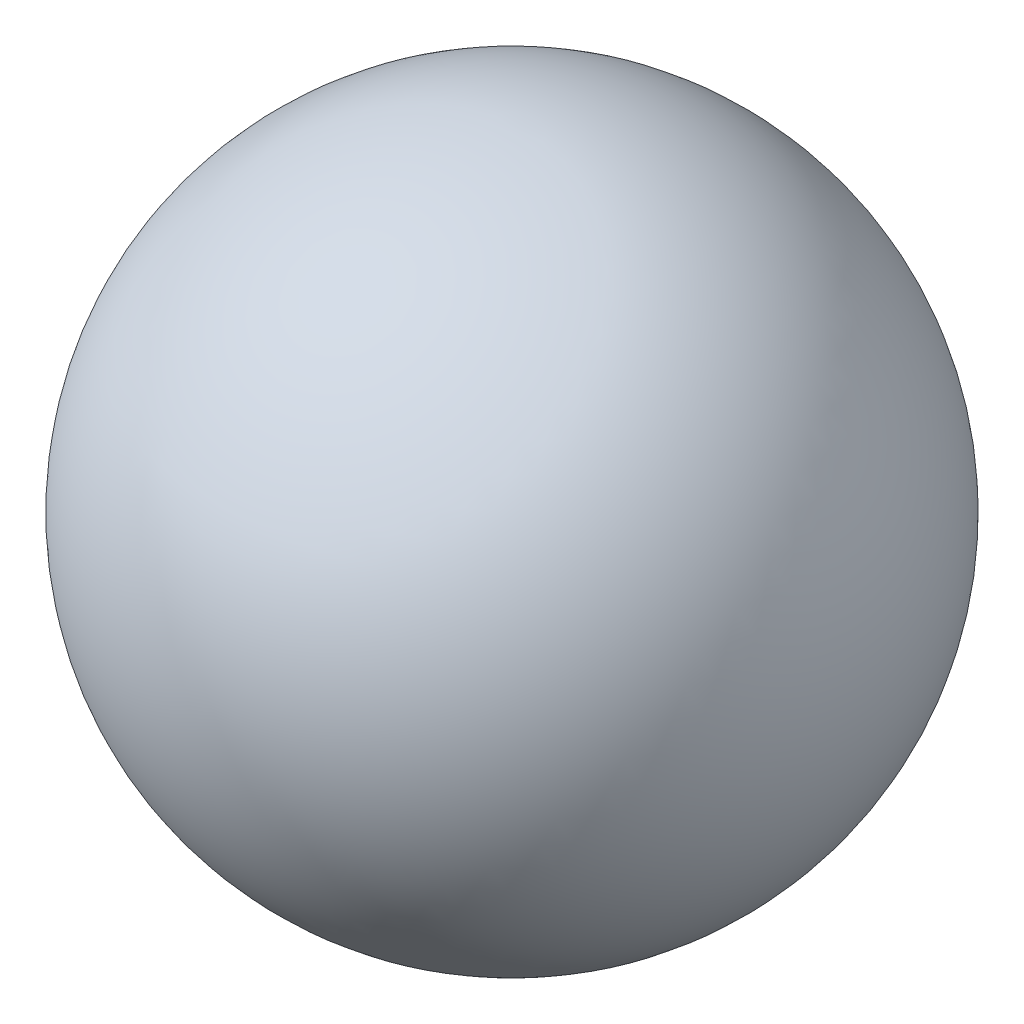
ISO-10303-21;
HEADER;
FILE_DESCRIPTION(('STEP AP214'),'2;1');
FILE_NAME('part.step','',(''),(''),'','','');
FILE_SCHEMA(('AUTOMOTIVE_DESIGN { 1 0 10303 214 1 1 1 1 }'));
ENDSEC;
DATA;
#1=APPLICATION_CONTEXT('core data for automotive mechanical design processes');
#2=APPLICATION_PROTOCOL_DEFINITION('international standard','automotive_design',2000,#1);
#3=PRODUCT_CONTEXT('',#1,'mechanical');
#4=PRODUCT('Part','Part','',(#3));
#5=PRODUCT_RELATED_PRODUCT_CATEGORY('part','',(#4));
#6=PRODUCT_DEFINITION_FORMATION('','',#4);
#7=PRODUCT_DEFINITION_CONTEXT('part definition',#1,'design');
#8=PRODUCT_DEFINITION('design','',#6,#7);
#9=PRODUCT_DEFINITION_SHAPE('','',#8);
#10=(LENGTH_UNIT() NAMED_UNIT(*) SI_UNIT(.MILLI.,.METRE.));
#11=(NAMED_UNIT(*) PLANE_ANGLE_UNIT() SI_UNIT($,.RADIAN.));
#12=(NAMED_UNIT(*) SI_UNIT($,.STERADIAN.) SOLID_ANGLE_UNIT());
#13=UNCERTAINTY_MEASURE_WITH_UNIT(LENGTH_MEASURE(1.E-05),#10,'distance_accuracy_value','');
#14=(GEOMETRIC_REPRESENTATION_CONTEXT(3) GLOBAL_UNCERTAINTY_ASSIGNED_CONTEXT((#13)) GLOBAL_UNIT_ASSIGNED_CONTEXT((#10,
#11,#12)) REPRESENTATION_CONTEXT('',''));
#15=CARTESIAN_POINT('',(0.,0.,0.));
#16=DIRECTION('',(0.,0.,1.));
#17=DIRECTION('',(1.,0.,0.));
#18=AXIS2_PLACEMENT_3D('',#15,#16,#17);
#19=CARTESIAN_POINT('',(-0.7065039653113,0.,-3.095396121177));
#20=DIRECTION('',(0.,-1.,0.));
#21=DIRECTION('',(0.974927912181826,0.,-0.222520933956306));
#22=AXIS2_PLACEMENT_3D('',#19,#20,#21);
#23=SPHERICAL_SURFACE('',#22,0.794);
#24=CARTESIAN_POINT('',(-0.7065039653113,-0.794,-3.095396121177));
#25=VERTEX_POINT('',#24);
#26=VERTEX_LOOP('',#25);
#27=FACE_BOUND('',#26,.T.);
#28=ADVANCED_FACE('F12',(#27),#23,.T.);
#29=CLOSED_SHELL('',(#28));
#30=MANIFOLD_SOLID_BREP('B1',#29);
#31=ADVANCED_BREP_SHAPE_REPRESENTATION('',(#18,#30),#14);
#32=SHAPE_DEFINITION_REPRESENTATION(#9,#31);
ENDSEC;
END-ISO-10303-21;
